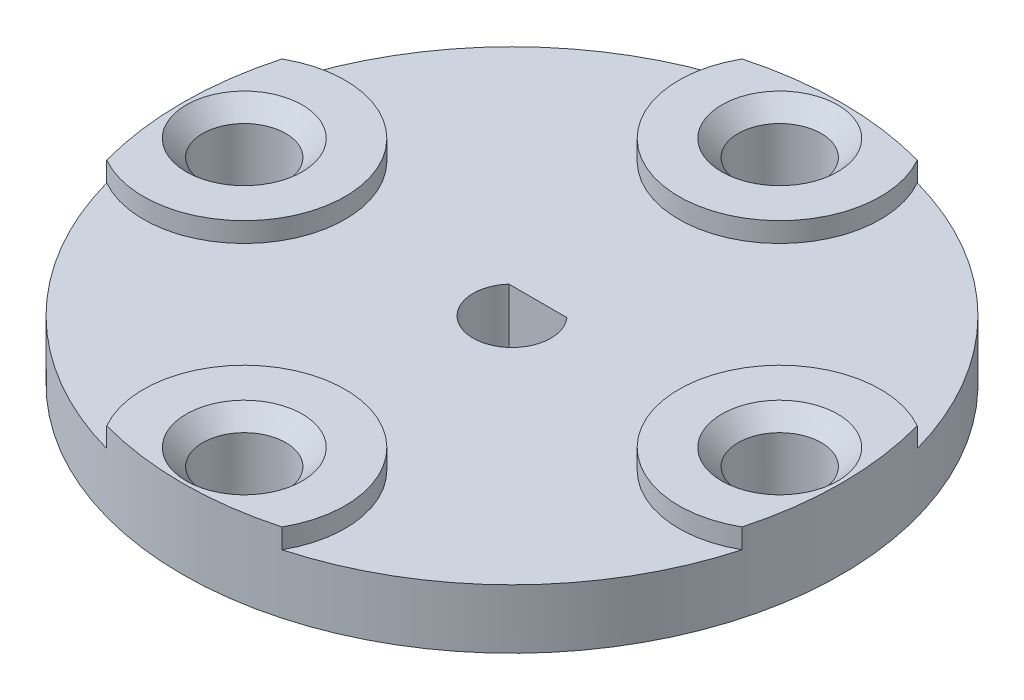
ISO-10303-21;
HEADER;
FILE_DESCRIPTION(('STEP AP214'),'2;1');
FILE_NAME('part.step','',(''),(''),'','','');
FILE_SCHEMA(('AUTOMOTIVE_DESIGN { 1 0 10303 214 1 1 1 1 }'));
ENDSEC;
DATA;
#1=APPLICATION_CONTEXT('core data for automotive mechanical design processes');
#2=APPLICATION_PROTOCOL_DEFINITION('international standard','automotive_design',2000,#1);
#3=PRODUCT_CONTEXT('',#1,'mechanical');
#4=PRODUCT('Part','Part','',(#3));
#5=PRODUCT_RELATED_PRODUCT_CATEGORY('part','',(#4));
#6=PRODUCT_DEFINITION_FORMATION('','',#4);
#7=PRODUCT_DEFINITION_CONTEXT('part definition',#1,'design');
#8=PRODUCT_DEFINITION('design','',#6,#7);
#9=PRODUCT_DEFINITION_SHAPE('','',#8);
#10=(LENGTH_UNIT() NAMED_UNIT(*) SI_UNIT(.MILLI.,.METRE.));
#11=(NAMED_UNIT(*) PLANE_ANGLE_UNIT() SI_UNIT($,.RADIAN.));
#12=(NAMED_UNIT(*) SI_UNIT($,.STERADIAN.) SOLID_ANGLE_UNIT());
#13=UNCERTAINTY_MEASURE_WITH_UNIT(LENGTH_MEASURE(1.E-05),#10,'distance_accuracy_value','');
#14=(GEOMETRIC_REPRESENTATION_CONTEXT(3) GLOBAL_UNCERTAINTY_ASSIGNED_CONTEXT((#13)) GLOBAL_UNIT_ASSIGNED_CONTEXT((#10,
#11,#12)) REPRESENTATION_CONTEXT('',''));
#15=CARTESIAN_POINT('',(0.,0.,0.));
#16=DIRECTION('',(0.,0.,1.));
#17=DIRECTION('',(1.,0.,0.));
#18=AXIS2_PLACEMENT_3D('',#15,#16,#17);
#19=CARTESIAN_POINT('',(0.,0.,0.));
#20=DIRECTION('',(0.,1.,0.));
#21=DIRECTION('',(0.,0.,1.));
#22=AXIS2_PLACEMENT_3D('',#19,#20,#21);
#23=PLANE('',#22);
#24=CARTESIAN_POINT('',(0.,0.,0.));
#25=DIRECTION('',(0.,1.,0.));
#26=DIRECTION('',(0.,0.,1.));
#27=AXIS2_PLACEMENT_3D('',#24,#25,#26);
#28=CIRCLE('',#27,12.7);
#29=CARTESIAN_POINT('',(0.,0.,12.7));
#30=VERTEX_POINT('',#29);
#31=EDGE_CURVE('E122',#30,#30,#28,.T.);
#32=ORIENTED_EDGE('',*,*,#31,.F.);
#33=EDGE_LOOP('',(#32));
#34=FACE_BOUND('',#33,.T.);
#35=CARTESIAN_POINT('',(-10.31875,0.,0.));
#36=DIRECTION('',(0.,1.,0.));
#37=DIRECTION('',(0.,0.,1.));
#38=AXIS2_PLACEMENT_3D('',#35,#36,#37);
#39=CIRCLE('',#38,1.6002);
#40=CARTESIAN_POINT('',(-10.31875,0.,1.6002));
#41=VERTEX_POINT('',#40);
#42=EDGE_CURVE('E195',#41,#41,#39,.T.);
#43=ORIENTED_EDGE('',*,*,#42,.T.);
#44=EDGE_LOOP('',(#43));
#45=FACE_BOUND('',#44,.T.);
#46=CARTESIAN_POINT('',(0.,0.,10.31875));
#47=DIRECTION('',(0.,1.,0.));
#48=DIRECTION('',(1.,0.,0.));
#49=AXIS2_PLACEMENT_3D('',#46,#47,#48);
#50=CIRCLE('',#49,1.6002);
#51=CARTESIAN_POINT('',(1.60020000000003,0.,10.31875));
#52=VERTEX_POINT('',#51);
#53=EDGE_CURVE('E190',#52,#52,#50,.T.);
#54=ORIENTED_EDGE('',*,*,#53,.T.);
#55=EDGE_LOOP('',(#54));
#56=FACE_BOUND('',#55,.T.);
#57=CARTESIAN_POINT('',(-1.08083169195563E-13,0.,-10.31875));
#58=DIRECTION('',(0.,1.,0.));
#59=DIRECTION('',(-1.,0.,0.));
#60=AXIS2_PLACEMENT_3D('',#57,#58,#59);
#61=CIRCLE('',#60,1.6002);
#62=CARTESIAN_POINT('',(-1.60020000000011,0.,-10.31875));
#63=VERTEX_POINT('',#62);
#64=EDGE_CURVE('E186',#63,#63,#61,.T.);
#65=ORIENTED_EDGE('',*,*,#64,.T.);
#66=EDGE_LOOP('',(#65));
#67=FACE_BOUND('',#66,.T.);
#68=CARTESIAN_POINT('',(10.31875,0.,0.));
#69=DIRECTION('',(0.,1.,0.));
#70=DIRECTION('',(0.,0.,-1.));
#71=AXIS2_PLACEMENT_3D('',#68,#69,#70);
#72=CIRCLE('',#71,1.6002);
#73=CARTESIAN_POINT('',(10.31875,0.,-1.6002));
#74=VERTEX_POINT('',#73);
#75=EDGE_CURVE('E187',#74,#74,#72,.T.);
#76=ORIENTED_EDGE('',*,*,#75,.T.);
#77=EDGE_LOOP('',(#76));
#78=FACE_BOUND('',#77,.T.);
#79=CARTESIAN_POINT('',(0.,0.,0.));
#80=DIRECTION('',(0.,1.,0.));
#81=DIRECTION('',(0.,0.,1.));
#82=AXIS2_PLACEMENT_3D('',#79,#80,#81);
#83=CIRCLE('',#82,3.0861);
#84=CARTESIAN_POINT('',(0.,0.,3.0861));
#85=VERTEX_POINT('',#84);
#86=EDGE_CURVE('E231',#85,#85,#83,.F.);
#87=ORIENTED_EDGE('',*,*,#86,.F.);
#88=EDGE_LOOP('',(#87));
#89=FACE_BOUND('',#88,.T.);
#90=ADVANCED_FACE('F34',(#34,#45,#56,#67,#78,#89),#23,.F.);
#91=CARTESIAN_POINT('',(0.,2.286,0.));
#92=DIRECTION('',(0.,1.,0.));
#93=DIRECTION('',(0.,0.,1.));
#94=AXIS2_PLACEMENT_3D('',#91,#92,#93);
#95=PLANE('',#94);
#96=DIRECTION('',(-1.,0.,0.));
#97=VECTOR('',#96,1.);
#98=CARTESIAN_POINT('',(-1.1176,2.286,-0.998384795557304));
#99=LINE('',#98,#97);
#100=CARTESIAN_POINT('',(1.1176,2.286,-0.998384795557304));
#101=VERTEX_POINT('',#100);
#102=CARTESIAN_POINT('',(-1.1176,2.286,-0.998384795557304));
#103=VERTEX_POINT('',#102);
#104=EDGE_CURVE('E199',#101,#103,#99,.T.);
#105=ORIENTED_EDGE('',*,*,#104,.F.);
#106=CARTESIAN_POINT('',(0.,2.286,0.));
#107=DIRECTION('',(0.,1.,0.));
#108=DIRECTION('',(0.,0.,1.));
#109=AXIS2_PLACEMENT_3D('',#106,#107,#108);
#110=CIRCLE('',#109,1.4986);
#111=EDGE_CURVE('E119',#103,#101,#110,.T.);
#112=ORIENTED_EDGE('',*,*,#111,.F.);
#113=EDGE_LOOP('',(#105,#112));
#114=FACE_BOUND('',#113,.T.);
#115=CARTESIAN_POINT('',(0.,2.286,0.));
#116=DIRECTION('',(0.,1.,0.));
#117=DIRECTION('',(0.,0.,1.));
#118=AXIS2_PLACEMENT_3D('',#115,#116,#117);
#119=CIRCLE('',#118,12.7);
#120=CARTESIAN_POINT('',(-12.2429582615385,2.286,3.37638460579169));
#121=VERTEX_POINT('',#120);
#122=CARTESIAN_POINT('',(-3.37638460579164,2.286,12.2429582615385));
#123=VERTEX_POINT('',#122);
#124=EDGE_CURVE('E49',#121,#123,#119,.T.);
#125=ORIENTED_EDGE('',*,*,#124,.T.);
#126=CARTESIAN_POINT('',(0.,2.286,10.31875));
#127=DIRECTION('',(0.,1.,0.));
#128=DIRECTION('',(0.,0.,1.));
#129=AXIS2_PLACEMENT_3D('',#126,#127,#128);
#130=CIRCLE('',#129,3.8862);
#131=CARTESIAN_POINT('',(3.37638460579173,2.286,12.2429582615385));
#132=VERTEX_POINT('',#131);
#133=EDGE_CURVE('E128',#132,#123,#130,.T.);
#134=ORIENTED_EDGE('',*,*,#133,.F.);
#135=CARTESIAN_POINT('',(12.2429582615385,2.286,3.37638460579169));
#136=VERTEX_POINT('',#135);
#137=EDGE_CURVE('E204',#132,#136,#119,.T.);
#138=ORIENTED_EDGE('',*,*,#137,.T.);
#139=CARTESIAN_POINT('',(10.31875,2.286,0.));
#140=DIRECTION('',(0.,1.,0.));
#141=DIRECTION('',(0.,0.,1.));
#142=AXIS2_PLACEMENT_3D('',#139,#140,#141);
#143=CIRCLE('',#142,3.8862);
#144=CARTESIAN_POINT('',(12.2429582615385,2.286,-3.37638460579169));
#145=VERTEX_POINT('',#144);
#146=EDGE_CURVE('E158',#145,#136,#143,.T.);
#147=ORIENTED_EDGE('',*,*,#146,.F.);
#148=CARTESIAN_POINT('',(3.37638460579156,2.286,-12.2429582615385));
#149=VERTEX_POINT('',#148);
#150=EDGE_CURVE('E205',#145,#149,#119,.T.);
#151=ORIENTED_EDGE('',*,*,#150,.T.);
#152=CARTESIAN_POINT('',(-1.08083169195563E-13,2.286,-10.31875));
#153=DIRECTION('',(0.,1.,0.));
#154=DIRECTION('',(0.,0.,1.));
#155=AXIS2_PLACEMENT_3D('',#152,#153,#154);
#156=CIRCLE('',#155,3.8862);
#157=CARTESIAN_POINT('',(-3.37638460579182,2.286,-12.2429582615384));
#158=VERTEX_POINT('',#157);
#159=EDGE_CURVE('E172',#158,#149,#156,.T.);
#160=ORIENTED_EDGE('',*,*,#159,.F.);
#161=CARTESIAN_POINT('',(-12.2429582615385,2.286,-3.37638460579169));
#162=VERTEX_POINT('',#161);
#163=EDGE_CURVE('E55',#158,#162,#119,.T.);
#164=ORIENTED_EDGE('',*,*,#163,.T.);
#165=CARTESIAN_POINT('',(-10.31875,2.286,0.));
#166=DIRECTION('',(0.,1.,0.));
#167=DIRECTION('',(0.,0.,1.));
#168=AXIS2_PLACEMENT_3D('',#165,#166,#167);
#169=CIRCLE('',#168,3.8862);
#170=EDGE_CURVE('E145',#121,#162,#169,.T.);
#171=ORIENTED_EDGE('',*,*,#170,.F.);
#172=EDGE_LOOP('',(#125,#134,#138,#147,#151,#160,#164,#171));
#173=FACE_BOUND('',#172,.T.);
#174=ADVANCED_FACE('F247',(#114,#173),#95,.T.);
#175=CARTESIAN_POINT('',(0.,2.286,0.));
#176=DIRECTION('',(0.,-1.,0.));
#177=DIRECTION('',(0.,0.,-1.));
#178=AXIS2_PLACEMENT_3D('',#175,#176,#177);
#179=CYLINDRICAL_SURFACE('',#178,12.7);
#180=ORIENTED_EDGE('',*,*,#163,.F.);
#181=DIRECTION('',(0.,-1.,0.));
#182=VECTOR('',#181,1.);
#183=CARTESIAN_POINT('',(-3.37638460579182,3.048,-12.2429582615384));
#184=LINE('',#183,#182);
#185=CARTESIAN_POINT('',(-3.37638460579182,3.048,-12.2429582615384));
#186=VERTEX_POINT('',#185);
#187=EDGE_CURVE('E183',#186,#158,#184,.T.);
#188=ORIENTED_EDGE('',*,*,#187,.F.);
#189=CARTESIAN_POINT('',(0.,3.048,0.));
#190=DIRECTION('',(0.,1.,0.));
#191=DIRECTION('',(0.,0.,1.));
#192=AXIS2_PLACEMENT_3D('',#189,#190,#191);
#193=CIRCLE('',#192,12.7);
#194=CARTESIAN_POINT('',(3.37638460579156,3.048,-12.2429582615385));
#195=VERTEX_POINT('',#194);
#196=EDGE_CURVE('E173',#195,#186,#193,.T.);
#197=ORIENTED_EDGE('',*,*,#196,.F.);
#198=DIRECTION('',(0.,-1.,0.));
#199=VECTOR('',#198,1.);
#200=CARTESIAN_POINT('',(3.37638460579156,3.048,-12.2429582615385));
#201=LINE('',#200,#199);
#202=EDGE_CURVE('E178',#195,#149,#201,.T.);
#203=ORIENTED_EDGE('',*,*,#202,.T.);
#204=ORIENTED_EDGE('',*,*,#150,.F.);
#205=DIRECTION('',(0.,-1.,0.));
#206=VECTOR('',#205,1.);
#207=CARTESIAN_POINT('',(12.2429582615385,3.048,-3.37638460579169));
#208=LINE('',#207,#206);
#209=CARTESIAN_POINT('',(12.2429582615385,3.048,-3.37638460579169));
#210=VERTEX_POINT('',#209);
#211=EDGE_CURVE('E169',#210,#145,#208,.T.);
#212=ORIENTED_EDGE('',*,*,#211,.F.);
#213=CARTESIAN_POINT('',(0.,3.048,0.));
#214=DIRECTION('',(0.,1.,0.));
#215=DIRECTION('',(0.,0.,1.));
#216=AXIS2_PLACEMENT_3D('',#213,#214,#215);
#217=CIRCLE('',#216,12.7);
#218=CARTESIAN_POINT('',(12.2429582615385,3.048,3.37638460579169));
#219=VERTEX_POINT('',#218);
#220=EDGE_CURVE('E159',#219,#210,#217,.T.);
#221=ORIENTED_EDGE('',*,*,#220,.F.);
#222=DIRECTION('',(0.,-1.,0.));
#223=VECTOR('',#222,1.);
#224=CARTESIAN_POINT('',(12.2429582615385,3.048,3.37638460579169));
#225=LINE('',#224,#223);
#226=EDGE_CURVE('E164',#219,#136,#225,.T.);
#227=ORIENTED_EDGE('',*,*,#226,.T.);
#228=ORIENTED_EDGE('',*,*,#137,.F.);
#229=DIRECTION('',(0.,-1.,0.));
#230=VECTOR('',#229,1.);
#231=CARTESIAN_POINT('',(3.37638460579173,3.048,12.2429582615385));
#232=LINE('',#231,#230);
#233=CARTESIAN_POINT('',(3.37638460579173,3.048,12.2429582615385));
#234=VERTEX_POINT('',#233);
#235=EDGE_CURVE('E142',#234,#132,#232,.T.);
#236=ORIENTED_EDGE('',*,*,#235,.F.);
#237=CARTESIAN_POINT('',(0.,3.048,0.));
#238=DIRECTION('',(0.,1.,0.));
#239=DIRECTION('',(0.,0.,1.));
#240=AXIS2_PLACEMENT_3D('',#237,#238,#239);
#241=CIRCLE('',#240,12.7);
#242=CARTESIAN_POINT('',(-3.37638460579165,3.048,12.2429582615385));
#243=VERTEX_POINT('',#242);
#244=EDGE_CURVE('E133',#243,#234,#241,.T.);
#245=ORIENTED_EDGE('',*,*,#244,.F.);
#246=DIRECTION('',(0.,-1.,0.));
#247=VECTOR('',#246,1.);
#248=CARTESIAN_POINT('',(-3.37638460579165,3.048,12.2429582615385));
#249=LINE('',#248,#247);
#250=EDGE_CURVE('E138',#243,#123,#249,.T.);
#251=ORIENTED_EDGE('',*,*,#250,.T.);
#252=ORIENTED_EDGE('',*,*,#124,.F.);
#253=DIRECTION('',(0.,-1.,0.));
#254=VECTOR('',#253,1.);
#255=CARTESIAN_POINT('',(-12.2429582615385,3.048,3.37638460579169));
#256=LINE('',#255,#254);
#257=CARTESIAN_POINT('',(-12.2429582615385,3.048,3.37638460579169));
#258=VERTEX_POINT('',#257);
#259=EDGE_CURVE('E155',#258,#121,#256,.T.);
#260=ORIENTED_EDGE('',*,*,#259,.F.);
#261=CARTESIAN_POINT('',(0.,3.048,0.));
#262=DIRECTION('',(0.,1.,0.));
#263=DIRECTION('',(0.,0.,1.));
#264=AXIS2_PLACEMENT_3D('',#261,#262,#263);
#265=CIRCLE('',#264,12.7);
#266=CARTESIAN_POINT('',(-12.2429582615385,3.048,-3.37638460579169));
#267=VERTEX_POINT('',#266);
#268=EDGE_CURVE('E146',#267,#258,#265,.T.);
#269=ORIENTED_EDGE('',*,*,#268,.F.);
#270=DIRECTION('',(0.,-1.,0.));
#271=VECTOR('',#270,1.);
#272=CARTESIAN_POINT('',(-12.2429582615385,3.048,-3.37638460579169));
#273=LINE('',#272,#271);
#274=EDGE_CURVE('E151',#267,#162,#273,.T.);
#275=ORIENTED_EDGE('',*,*,#274,.T.);
#276=EDGE_LOOP('',(#180,#188,#197,#203,#204,#212,#221,#227,#228,#236,#245,#251,#252,#260,#269,#275));
#277=FACE_BOUND('',#276,.T.);
#278=ORIENTED_EDGE('',*,*,#31,.T.);
#279=EDGE_LOOP('',(#278));
#280=FACE_BOUND('',#279,.T.);
#281=ADVANCED_FACE('F253',(#277,#280),#179,.T.);
#282=CARTESIAN_POINT('',(0.,2.286,0.));
#283=DIRECTION('',(0.,-1.,0.));
#284=DIRECTION('',(0.,0.,-1.));
#285=AXIS2_PLACEMENT_3D('',#282,#283,#284);
#286=CYLINDRICAL_SURFACE('',#285,1.4986);
#287=DIRECTION('',(0.,-1.,0.));
#288=VECTOR('',#287,1.);
#289=CARTESIAN_POINT('',(1.1176,2.286,-0.998384795557304));
#290=LINE('',#289,#288);
#291=CARTESIAN_POINT('',(1.1176,-0.9525,-0.998384795557304));
#292=VERTEX_POINT('',#291);
#293=EDGE_CURVE('E111',#101,#292,#290,.T.);
#294=ORIENTED_EDGE('',*,*,#293,.T.);
#295=CARTESIAN_POINT('',(0.,-0.9525,0.));
#296=DIRECTION('',(0.,-1.,0.));
#297=DIRECTION('',(0.,0.,-1.));
#298=AXIS2_PLACEMENT_3D('',#295,#296,#297);
#299=CIRCLE('',#298,1.4986);
#300=CARTESIAN_POINT('',(-1.1176,-0.9525,-0.998384795557304));
#301=VERTEX_POINT('',#300);
#302=EDGE_CURVE('E116',#292,#301,#299,.T.);
#303=ORIENTED_EDGE('',*,*,#302,.T.);
#304=DIRECTION('',(0.,-1.,0.));
#305=VECTOR('',#304,1.);
#306=CARTESIAN_POINT('',(-1.1176,2.286,-0.998384795557304));
#307=LINE('',#306,#305);
#308=EDGE_CURVE('E123',#103,#301,#307,.T.);
#309=ORIENTED_EDGE('',*,*,#308,.F.);
#310=ORIENTED_EDGE('',*,*,#111,.T.);
#311=EDGE_LOOP('',(#294,#303,#309,#310));
#312=FACE_BOUND('',#311,.T.);
#313=ADVANCED_FACE('F113',(#312),#286,.F.);
#314=CARTESIAN_POINT('',(-1.1176,2.286,-0.998384795557304));
#315=DIRECTION('',(0.,0.,1.));
#316=DIRECTION('',(1.,0.,0.));
#317=AXIS2_PLACEMENT_3D('',#314,#315,#316);
#318=PLANE('',#317);
#319=ORIENTED_EDGE('',*,*,#308,.T.);
#320=DIRECTION('',(1.,0.,0.));
#321=VECTOR('',#320,1.);
#322=CARTESIAN_POINT('',(1.1176,-0.9525,-0.998384795557304));
#323=LINE('',#322,#321);
#324=EDGE_CURVE('E125',#301,#292,#323,.T.);
#325=ORIENTED_EDGE('',*,*,#324,.T.);
#326=ORIENTED_EDGE('',*,*,#293,.F.);
#327=ORIENTED_EDGE('',*,*,#104,.T.);
#328=EDGE_LOOP('',(#319,#325,#326,#327));
#329=FACE_BOUND('',#328,.T.);
#330=ADVANCED_FACE('F126',(#329),#318,.T.);
#331=CARTESIAN_POINT('',(-10.31875,0.,0.));
#332=DIRECTION('',(0.,1.,0.));
#333=DIRECTION('',(0.,0.,1.));
#334=AXIS2_PLACEMENT_3D('',#331,#332,#333);
#335=CYLINDRICAL_SURFACE('',#334,1.6002);
#336=CARTESIAN_POINT('',(-10.31875,2.413,0.));
#337=DIRECTION('',(0.,1.,0.));
#338=DIRECTION('',(0.,0.,1.));
#339=AXIS2_PLACEMENT_3D('',#336,#337,#338);
#340=CIRCLE('',#339,1.6002);
#341=CARTESIAN_POINT('',(-10.31875,2.413,1.6002));
#342=VERTEX_POINT('',#341);
#343=EDGE_CURVE('E225',#342,#342,#340,.T.);
#344=ORIENTED_EDGE('',*,*,#343,.T.);
#345=EDGE_LOOP('',(#344));
#346=FACE_BOUND('',#345,.T.);
#347=ORIENTED_EDGE('',*,*,#42,.F.);
#348=EDGE_LOOP('',(#347));
#349=FACE_BOUND('',#348,.T.);
#350=ADVANCED_FACE('F286',(#346,#349),#335,.F.);
#351=CARTESIAN_POINT('',(0.,0.,10.31875));
#352=DIRECTION('',(0.,1.,0.));
#353=DIRECTION('',(0.,0.,1.));
#354=AXIS2_PLACEMENT_3D('',#351,#352,#353);
#355=CYLINDRICAL_SURFACE('',#354,1.6002);
#356=CARTESIAN_POINT('',(0.,2.413,10.31875));
#357=DIRECTION('',(0.,1.,0.));
#358=DIRECTION('',(0.,0.,1.));
#359=AXIS2_PLACEMENT_3D('',#356,#357,#358);
#360=CIRCLE('',#359,1.6002);
#361=CARTESIAN_POINT('',(0.,2.413,11.91895));
#362=VERTEX_POINT('',#361);
#363=EDGE_CURVE('E203',#362,#362,#360,.T.);
#364=ORIENTED_EDGE('',*,*,#363,.T.);
#365=EDGE_LOOP('',(#364));
#366=FACE_BOUND('',#365,.T.);
#367=ORIENTED_EDGE('',*,*,#53,.F.);
#368=EDGE_LOOP('',(#367));
#369=FACE_BOUND('',#368,.T.);
#370=ADVANCED_FACE('F289',(#366,#369),#355,.F.);
#371=CARTESIAN_POINT('',(-1.08083169195563E-13,0.,-10.31875));
#372=DIRECTION('',(0.,1.,0.));
#373=DIRECTION('',(0.,0.,1.));
#374=AXIS2_PLACEMENT_3D('',#371,#372,#373);
#375=CYLINDRICAL_SURFACE('',#374,1.6002);
#376=CARTESIAN_POINT('',(-1.08083169195563E-13,2.413,-10.31875));
#377=DIRECTION('',(0.,1.,0.));
#378=DIRECTION('',(0.,0.,1.));
#379=AXIS2_PLACEMENT_3D('',#376,#377,#378);
#380=CIRCLE('',#379,1.6002);
#381=CARTESIAN_POINT('',(-1.08083169195563E-13,2.413,-8.71855));
#382=VERTEX_POINT('',#381);
#383=EDGE_CURVE('E219',#382,#382,#380,.T.);
#384=ORIENTED_EDGE('',*,*,#383,.T.);
#385=EDGE_LOOP('',(#384));
#386=FACE_BOUND('',#385,.T.);
#387=ORIENTED_EDGE('',*,*,#64,.F.);
#388=EDGE_LOOP('',(#387));
#389=FACE_BOUND('',#388,.T.);
#390=ADVANCED_FACE('F305',(#386,#389),#375,.F.);
#391=CARTESIAN_POINT('',(10.31875,0.,0.));
#392=DIRECTION('',(0.,1.,0.));
#393=DIRECTION('',(0.,0.,1.));
#394=AXIS2_PLACEMENT_3D('',#391,#392,#393);
#395=CYLINDRICAL_SURFACE('',#394,1.6002);
#396=CARTESIAN_POINT('',(10.31875,2.413,0.));
#397=DIRECTION('',(0.,1.,0.));
#398=DIRECTION('',(0.,0.,1.));
#399=AXIS2_PLACEMENT_3D('',#396,#397,#398);
#400=CIRCLE('',#399,1.6002);
#401=CARTESIAN_POINT('',(10.31875,2.413,1.6002));
#402=VERTEX_POINT('',#401);
#403=EDGE_CURVE('E213',#402,#402,#400,.T.);
#404=ORIENTED_EDGE('',*,*,#403,.T.);
#405=EDGE_LOOP('',(#404));
#406=FACE_BOUND('',#405,.T.);
#407=ORIENTED_EDGE('',*,*,#75,.F.);
#408=EDGE_LOOP('',(#407));
#409=FACE_BOUND('',#408,.T.);
#410=ADVANCED_FACE('F302',(#406,#409),#395,.F.);
#411=CARTESIAN_POINT('',(0.,3.048,-5.159375));
#412=DIRECTION('',(0.,1.,0.));
#413=DIRECTION('',(0.,0.,1.));
#414=AXIS2_PLACEMENT_3D('',#411,#412,#413);
#415=PLANE('',#414);
#416=CARTESIAN_POINT('',(-1.08083169195563E-13,3.048,-10.31875));
#417=DIRECTION('',(0.,1.,0.));
#418=DIRECTION('',(0.,0.,1.));
#419=AXIS2_PLACEMENT_3D('',#416,#417,#418);
#420=CIRCLE('',#419,2.2352);
#421=CARTESIAN_POINT('',(-1.08083169195563E-13,3.048,-8.08355));
#422=VERTEX_POINT('',#421);
#423=EDGE_CURVE('E222',#422,#422,#420,.F.);
#424=ORIENTED_EDGE('',*,*,#423,.T.);
#425=EDGE_LOOP('',(#424));
#426=FACE_BOUND('',#425,.T.);
#427=ORIENTED_EDGE('',*,*,#196,.T.);
#428=CARTESIAN_POINT('',(-1.08083169195563E-13,3.048,-10.31875));
#429=DIRECTION('',(0.,1.,0.));
#430=DIRECTION('',(0.,0.,1.));
#431=AXIS2_PLACEMENT_3D('',#428,#429,#430);
#432=CIRCLE('',#431,3.8862);
#433=EDGE_CURVE('E176',#186,#195,#432,.T.);
#434=ORIENTED_EDGE('',*,*,#433,.T.);
#435=EDGE_LOOP('',(#427,#434));
#436=FACE_BOUND('',#435,.T.);
#437=ADVANCED_FACE('F304',(#426,#436),#415,.T.);
#438=CARTESIAN_POINT('',(-1.08083169195563E-13,3.048,-10.31875));
#439=DIRECTION('',(0.,-1.,0.));
#440=DIRECTION('',(0.,0.,-1.));
#441=AXIS2_PLACEMENT_3D('',#438,#439,#440);
#442=CYLINDRICAL_SURFACE('',#441,3.8862);
#443=ORIENTED_EDGE('',*,*,#159,.T.);
#444=ORIENTED_EDGE('',*,*,#202,.F.);
#445=ORIENTED_EDGE('',*,*,#433,.F.);
#446=ORIENTED_EDGE('',*,*,#187,.T.);
#447=EDGE_LOOP('',(#443,#444,#445,#446));
#448=FACE_BOUND('',#447,.T.);
#449=ADVANCED_FACE('F312',(#448),#442,.T.);
#450=CARTESIAN_POINT('',(5.159375,3.048,0.));
#451=DIRECTION('',(0.,1.,0.));
#452=DIRECTION('',(0.,0.,1.));
#453=AXIS2_PLACEMENT_3D('',#450,#451,#452);
#454=PLANE('',#453);
#455=CARTESIAN_POINT('',(10.31875,3.048,0.));
#456=DIRECTION('',(0.,1.,0.));
#457=DIRECTION('',(0.,0.,1.));
#458=AXIS2_PLACEMENT_3D('',#455,#456,#457);
#459=CIRCLE('',#458,2.2352);
#460=CARTESIAN_POINT('',(10.31875,3.048,2.2352));
#461=VERTEX_POINT('',#460);
#462=EDGE_CURVE('E216',#461,#461,#459,.F.);
#463=ORIENTED_EDGE('',*,*,#462,.T.);
#464=EDGE_LOOP('',(#463));
#465=FACE_BOUND('',#464,.T.);
#466=ORIENTED_EDGE('',*,*,#220,.T.);
#467=CARTESIAN_POINT('',(10.31875,3.048,0.));
#468=DIRECTION('',(0.,1.,0.));
#469=DIRECTION('',(0.,0.,1.));
#470=AXIS2_PLACEMENT_3D('',#467,#468,#469);
#471=CIRCLE('',#470,3.8862);
#472=EDGE_CURVE('E162',#210,#219,#471,.T.);
#473=ORIENTED_EDGE('',*,*,#472,.T.);
#474=EDGE_LOOP('',(#466,#473));
#475=FACE_BOUND('',#474,.T.);
#476=ADVANCED_FACE('F365',(#465,#475),#454,.T.);
#477=CARTESIAN_POINT('',(10.31875,3.048,0.));
#478=DIRECTION('',(0.,-1.,0.));
#479=DIRECTION('',(0.,0.,-1.));
#480=AXIS2_PLACEMENT_3D('',#477,#478,#479);
#481=CYLINDRICAL_SURFACE('',#480,3.8862);
#482=ORIENTED_EDGE('',*,*,#146,.T.);
#483=ORIENTED_EDGE('',*,*,#226,.F.);
#484=ORIENTED_EDGE('',*,*,#472,.F.);
#485=ORIENTED_EDGE('',*,*,#211,.T.);
#486=EDGE_LOOP('',(#482,#483,#484,#485));
#487=FACE_BOUND('',#486,.T.);
#488=ADVANCED_FACE('F370',(#487),#481,.T.);
#489=CARTESIAN_POINT('',(-5.159375,3.048,0.));
#490=DIRECTION('',(0.,1.,0.));
#491=DIRECTION('',(0.,0.,1.));
#492=AXIS2_PLACEMENT_3D('',#489,#490,#491);
#493=PLANE('',#492);
#494=CARTESIAN_POINT('',(-10.31875,3.048,0.));
#495=DIRECTION('',(0.,1.,0.));
#496=DIRECTION('',(0.,0.,1.));
#497=AXIS2_PLACEMENT_3D('',#494,#495,#496);
#498=CIRCLE('',#497,2.2352);
#499=CARTESIAN_POINT('',(-10.31875,3.048,2.2352));
#500=VERTEX_POINT('',#499);
#501=EDGE_CURVE('E228',#500,#500,#498,.F.);
#502=ORIENTED_EDGE('',*,*,#501,.T.);
#503=EDGE_LOOP('',(#502));
#504=FACE_BOUND('',#503,.T.);
#505=ORIENTED_EDGE('',*,*,#268,.T.);
#506=CARTESIAN_POINT('',(-10.31875,3.048,0.));
#507=DIRECTION('',(0.,1.,0.));
#508=DIRECTION('',(0.,0.,1.));
#509=AXIS2_PLACEMENT_3D('',#506,#507,#508);
#510=CIRCLE('',#509,3.8862);
#511=EDGE_CURVE('E149',#258,#267,#510,.T.);
#512=ORIENTED_EDGE('',*,*,#511,.T.);
#513=EDGE_LOOP('',(#505,#512));
#514=FACE_BOUND('',#513,.T.);
#515=ADVANCED_FACE('F378',(#504,#514),#493,.T.);
#516=CARTESIAN_POINT('',(-10.31875,3.048,0.));
#517=DIRECTION('',(0.,-1.,0.));
#518=DIRECTION('',(0.,0.,-1.));
#519=AXIS2_PLACEMENT_3D('',#516,#517,#518);
#520=CYLINDRICAL_SURFACE('',#519,3.8862);
#521=ORIENTED_EDGE('',*,*,#170,.T.);
#522=ORIENTED_EDGE('',*,*,#274,.F.);
#523=ORIENTED_EDGE('',*,*,#511,.F.);
#524=ORIENTED_EDGE('',*,*,#259,.T.);
#525=EDGE_LOOP('',(#521,#522,#523,#524));
#526=FACE_BOUND('',#525,.T.);
#527=ADVANCED_FACE('F383',(#526),#520,.T.);
#528=CARTESIAN_POINT('',(0.,3.048,5.159375));
#529=DIRECTION('',(0.,1.,0.));
#530=DIRECTION('',(0.,0.,1.));
#531=AXIS2_PLACEMENT_3D('',#528,#529,#530);
#532=PLANE('',#531);
#533=CARTESIAN_POINT('',(0.,3.048,10.31875));
#534=DIRECTION('',(0.,1.,0.));
#535=DIRECTION('',(0.,0.,1.));
#536=AXIS2_PLACEMENT_3D('',#533,#534,#535);
#537=CIRCLE('',#536,2.2352);
#538=CARTESIAN_POINT('',(0.,3.048,12.55395));
#539=VERTEX_POINT('',#538);
#540=EDGE_CURVE('E210',#539,#539,#537,.F.);
#541=ORIENTED_EDGE('',*,*,#540,.T.);
#542=EDGE_LOOP('',(#541));
#543=FACE_BOUND('',#542,.T.);
#544=ORIENTED_EDGE('',*,*,#244,.T.);
#545=CARTESIAN_POINT('',(0.,3.048,10.31875));
#546=DIRECTION('',(0.,1.,0.));
#547=DIRECTION('',(0.,0.,1.));
#548=AXIS2_PLACEMENT_3D('',#545,#546,#547);
#549=CIRCLE('',#548,3.8862);
#550=EDGE_CURVE('E136',#234,#243,#549,.T.);
#551=ORIENTED_EDGE('',*,*,#550,.T.);
#552=EDGE_LOOP('',(#544,#551));
#553=FACE_BOUND('',#552,.T.);
#554=ADVANCED_FACE('F391',(#543,#553),#532,.T.);
#555=CARTESIAN_POINT('',(0.,3.048,10.31875));
#556=DIRECTION('',(0.,-1.,0.));
#557=DIRECTION('',(0.,0.,-1.));
#558=AXIS2_PLACEMENT_3D('',#555,#556,#557);
#559=CYLINDRICAL_SURFACE('',#558,3.8862);
#560=ORIENTED_EDGE('',*,*,#133,.T.);
#561=ORIENTED_EDGE('',*,*,#250,.F.);
#562=ORIENTED_EDGE('',*,*,#550,.F.);
#563=ORIENTED_EDGE('',*,*,#235,.T.);
#564=EDGE_LOOP('',(#560,#561,#562,#563));
#565=FACE_BOUND('',#564,.T.);
#566=ADVANCED_FACE('F267',(#565),#559,.T.);
#567=CARTESIAN_POINT('',(0.,2.413,10.31875));
#568=DIRECTION('',(0.,1.,0.));
#569=DIRECTION('',(0.,0.,1.));
#570=AXIS2_PLACEMENT_3D('',#567,#568,#569);
#571=CONICAL_SURFACE('',#570,1.6002,0.785398163397453);
#572=ORIENTED_EDGE('',*,*,#540,.F.);
#573=EDGE_LOOP('',(#572));
#574=FACE_BOUND('',#573,.T.);
#575=ORIENTED_EDGE('',*,*,#363,.F.);
#576=EDGE_LOOP('',(#575));
#577=FACE_BOUND('',#576,.T.);
#578=ADVANCED_FACE('F263',(#574,#577),#571,.F.);
#579=CARTESIAN_POINT('',(10.31875,2.413,0.));
#580=DIRECTION('',(0.,1.,0.));
#581=DIRECTION('',(0.,0.,1.));
#582=AXIS2_PLACEMENT_3D('',#579,#580,#581);
#583=CONICAL_SURFACE('',#582,1.6002,0.785398163397452);
#584=ORIENTED_EDGE('',*,*,#462,.F.);
#585=EDGE_LOOP('',(#584));
#586=FACE_BOUND('',#585,.T.);
#587=ORIENTED_EDGE('',*,*,#403,.F.);
#588=EDGE_LOOP('',(#587));
#589=FACE_BOUND('',#588,.T.);
#590=ADVANCED_FACE('F266',(#586,#589),#583,.F.);
#591=CARTESIAN_POINT('',(-1.08083169195563E-13,2.413,-10.31875));
#592=DIRECTION('',(0.,1.,0.));
#593=DIRECTION('',(0.,0.,1.));
#594=AXIS2_PLACEMENT_3D('',#591,#592,#593);
#595=CONICAL_SURFACE('',#594,1.6002,0.785398163397453);
#596=ORIENTED_EDGE('',*,*,#423,.F.);
#597=EDGE_LOOP('',(#596));
#598=FACE_BOUND('',#597,.T.);
#599=ORIENTED_EDGE('',*,*,#383,.F.);
#600=EDGE_LOOP('',(#599));
#601=FACE_BOUND('',#600,.T.);
#602=ADVANCED_FACE('F271',(#598,#601),#595,.F.);
#603=CARTESIAN_POINT('',(-10.31875,2.413,0.));
#604=DIRECTION('',(0.,1.,0.));
#605=DIRECTION('',(0.,0.,1.));
#606=AXIS2_PLACEMENT_3D('',#603,#604,#605);
#607=CONICAL_SURFACE('',#606,1.6002,0.785398163397452);
#608=ORIENTED_EDGE('',*,*,#501,.F.);
#609=EDGE_LOOP('',(#608));
#610=FACE_BOUND('',#609,.T.);
#611=ORIENTED_EDGE('',*,*,#343,.F.);
#612=EDGE_LOOP('',(#611));
#613=FACE_BOUND('',#612,.T.);
#614=ADVANCED_FACE('F274',(#610,#613),#607,.F.);
#615=CARTESIAN_POINT('',(0.,-0.9525,0.));
#616=DIRECTION('',(0.,-1.,0.));
#617=DIRECTION('',(0.,0.,-1.));
#618=AXIS2_PLACEMENT_3D('',#615,#616,#617);
#619=PLANE('',#618);
#620=CARTESIAN_POINT('',(0.,-0.9525,0.));
#621=DIRECTION('',(0.,-1.,0.));
#622=DIRECTION('',(0.,0.,-1.));
#623=AXIS2_PLACEMENT_3D('',#620,#621,#622);
#624=CIRCLE('',#623,2.45110000000002);
#625=CARTESIAN_POINT('',(0.,-0.9525,-2.45110000000002));
#626=VERTEX_POINT('',#625);
#627=EDGE_CURVE('E42',#626,#626,#624,.T.);
#628=ORIENTED_EDGE('',*,*,#627,.T.);
#629=EDGE_LOOP('',(#628));
#630=FACE_BOUND('',#629,.T.);
#631=ORIENTED_EDGE('',*,*,#324,.F.);
#632=ORIENTED_EDGE('',*,*,#302,.F.);
#633=EDGE_LOOP('',(#631,#632));
#634=FACE_BOUND('',#633,.T.);
#635=ADVANCED_FACE('F130',(#630,#634),#619,.T.);
#636=CARTESIAN_POINT('',(0.,-0.9525,0.));
#637=DIRECTION('',(0.,1.,0.));
#638=DIRECTION('',(0.,0.,1.));
#639=AXIS2_PLACEMENT_3D('',#636,#637,#638);
#640=CYLINDRICAL_SURFACE('',#639,3.0861);
#641=CARTESIAN_POINT('',(0.,-0.317500000000014,0.));
#642=DIRECTION('',(0.,-1.,0.));
#643=DIRECTION('',(0.,0.,-1.));
#644=AXIS2_PLACEMENT_3D('',#641,#642,#643);
#645=CIRCLE('',#644,3.0861);
#646=CARTESIAN_POINT('',(0.,-0.317500000000014,-3.0861));
#647=VERTEX_POINT('',#646);
#648=EDGE_CURVE('E11',#647,#647,#645,.F.);
#649=ORIENTED_EDGE('',*,*,#648,.T.);
#650=EDGE_LOOP('',(#649));
#651=FACE_BOUND('',#650,.T.);
#652=ORIENTED_EDGE('',*,*,#86,.T.);
#653=EDGE_LOOP('',(#652));
#654=FACE_BOUND('',#653,.T.);
#655=ADVANCED_FACE('F238',(#651,#654),#640,.T.);
#656=CARTESIAN_POINT('',(0.,-0.9525,0.));
#657=DIRECTION('',(0.,1.,0.));
#658=DIRECTION('',(0.,0.,1.));
#659=AXIS2_PLACEMENT_3D('',#656,#657,#658);
#660=CONICAL_SURFACE('',#659,2.45110000000002,0.785398163397445);
#661=ORIENTED_EDGE('',*,*,#648,.F.);
#662=EDGE_LOOP('',(#661));
#663=FACE_BOUND('',#662,.T.);
#664=ORIENTED_EDGE('',*,*,#627,.F.);
#665=EDGE_LOOP('',(#664));
#666=FACE_BOUND('',#665,.T.);
#667=ADVANCED_FACE('F36',(#663,#666),#660,.T.);
#668=CLOSED_SHELL('',(#90,#174,#281,#313,#330,#350,#370,#390,#410,#437,#449,#476,#488,#515,#527,
#554,#566,#578,#590,#602,#614,#635,#655,#667));
#669=MANIFOLD_SOLID_BREP('B2',#668);
#670=ADVANCED_BREP_SHAPE_REPRESENTATION('',(#18,#669),#14);
#671=SHAPE_DEFINITION_REPRESENTATION(#9,#670);
ENDSEC;
END-ISO-10303-21;
